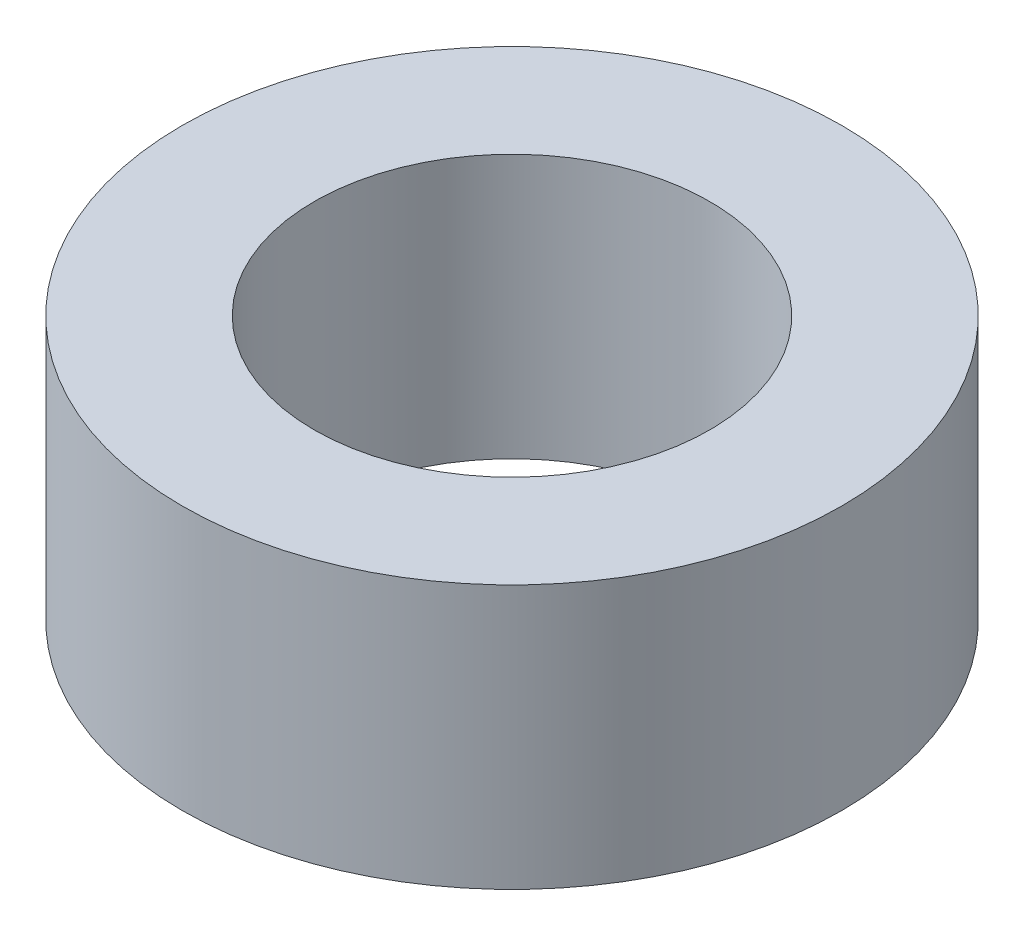
ISO-10303-21;
HEADER;
FILE_DESCRIPTION(('STEP AP214'),'2;1');
FILE_NAME('part.step','',(''),(''),'','','');
FILE_SCHEMA(('AUTOMOTIVE_DESIGN { 1 0 10303 214 1 1 1 1 }'));
ENDSEC;
DATA;
#1=APPLICATION_CONTEXT('core data for automotive mechanical design processes');
#2=APPLICATION_PROTOCOL_DEFINITION('international standard','automotive_design',2000,#1);
#3=PRODUCT_CONTEXT('',#1,'mechanical');
#4=PRODUCT('Part','Part','',(#3));
#5=PRODUCT_RELATED_PRODUCT_CATEGORY('part','',(#4));
#6=PRODUCT_DEFINITION_FORMATION('','',#4);
#7=PRODUCT_DEFINITION_CONTEXT('part definition',#1,'design');
#8=PRODUCT_DEFINITION('design','',#6,#7);
#9=PRODUCT_DEFINITION_SHAPE('','',#8);
#10=(LENGTH_UNIT() NAMED_UNIT(*) SI_UNIT(.MILLI.,.METRE.));
#11=(NAMED_UNIT(*) PLANE_ANGLE_UNIT() SI_UNIT($,.RADIAN.));
#12=(NAMED_UNIT(*) SI_UNIT($,.STERADIAN.) SOLID_ANGLE_UNIT());
#13=UNCERTAINTY_MEASURE_WITH_UNIT(LENGTH_MEASURE(1.E-05),#10,'distance_accuracy_value','');
#14=(GEOMETRIC_REPRESENTATION_CONTEXT(3) GLOBAL_UNCERTAINTY_ASSIGNED_CONTEXT((#13)) GLOBAL_UNIT_ASSIGNED_CONTEXT((#10,
#11,#12)) REPRESENTATION_CONTEXT('',''));
#15=CARTESIAN_POINT('',(0.,0.,0.));
#16=DIRECTION('',(0.,0.,1.));
#17=DIRECTION('',(1.,0.,0.));
#18=AXIS2_PLACEMENT_3D('',#15,#16,#17);
#19=CARTESIAN_POINT('',(0.,6.35,0.));
#20=DIRECTION('',(0.,-1.,0.));
#21=DIRECTION('',(0.,0.,-1.));
#22=AXIS2_PLACEMENT_3D('',#19,#20,#21);
#23=CYLINDRICAL_SURFACE('',#22,7.9375);
#24=CARTESIAN_POINT('',(0.,6.35,0.));
#25=DIRECTION('',(0.,1.,0.));
#26=DIRECTION('',(0.,0.,1.));
#27=AXIS2_PLACEMENT_3D('',#24,#25,#26);
#28=CIRCLE('',#27,7.9375);
#29=CARTESIAN_POINT('',(0.,6.35,7.9375));
#30=VERTEX_POINT('',#29);
#31=EDGE_CURVE('E10',#30,#30,#28,.T.);
#32=ORIENTED_EDGE('',*,*,#31,.F.);
#33=EDGE_LOOP('',(#32));
#34=FACE_BOUND('',#33,.T.);
#35=CARTESIAN_POINT('',(0.,0.,0.));
#36=DIRECTION('',(0.,1.,0.));
#37=DIRECTION('',(0.,0.,1.));
#38=AXIS2_PLACEMENT_3D('',#35,#36,#37);
#39=CIRCLE('',#38,7.9375);
#40=CARTESIAN_POINT('',(0.,0.,7.9375));
#41=VERTEX_POINT('',#40);
#42=EDGE_CURVE('E40',#41,#41,#39,.T.);
#43=ORIENTED_EDGE('',*,*,#42,.T.);
#44=EDGE_LOOP('',(#43));
#45=FACE_BOUND('',#44,.T.);
#46=ADVANCED_FACE('F37',(#34,#45),#23,.T.);
#47=CARTESIAN_POINT('',(0.,6.35,0.));
#48=DIRECTION('',(0.,1.,0.));
#49=DIRECTION('',(0.,0.,1.));
#50=AXIS2_PLACEMENT_3D('',#47,#48,#49);
#51=PLANE('',#50);
#52=CARTESIAN_POINT('',(0.,6.35,0.));
#53=DIRECTION('',(0.,1.,0.));
#54=DIRECTION('',(0.,0.,1.));
#55=AXIS2_PLACEMENT_3D('',#52,#53,#54);
#56=CIRCLE('',#55,4.7625);
#57=CARTESIAN_POINT('',(0.,6.35,4.7625));
#58=VERTEX_POINT('',#57);
#59=EDGE_CURVE('E51',#58,#58,#56,.T.);
#60=ORIENTED_EDGE('',*,*,#59,.F.);
#61=EDGE_LOOP('',(#60));
#62=FACE_BOUND('',#61,.T.);
#63=ORIENTED_EDGE('',*,*,#31,.T.);
#64=EDGE_LOOP('',(#63));
#65=FACE_BOUND('',#64,.T.);
#66=ADVANCED_FACE('F68',(#62,#65),#51,.T.);
#67=CARTESIAN_POINT('',(0.,0.,0.));
#68=DIRECTION('',(0.,1.,0.));
#69=DIRECTION('',(0.,0.,1.));
#70=AXIS2_PLACEMENT_3D('',#67,#68,#69);
#71=PLANE('',#70);
#72=CARTESIAN_POINT('',(0.,0.,0.));
#73=DIRECTION('',(0.,1.,0.));
#74=DIRECTION('',(0.,0.,1.));
#75=AXIS2_PLACEMENT_3D('',#72,#73,#74);
#76=CIRCLE('',#75,4.7625);
#77=CARTESIAN_POINT('',(0.,0.,4.7625));
#78=VERTEX_POINT('',#77);
#79=EDGE_CURVE('E49',#78,#78,#76,.T.);
#80=ORIENTED_EDGE('',*,*,#79,.T.);
#81=EDGE_LOOP('',(#80));
#82=FACE_BOUND('',#81,.T.);
#83=ORIENTED_EDGE('',*,*,#42,.F.);
#84=EDGE_LOOP('',(#83));
#85=FACE_BOUND('',#84,.T.);
#86=ADVANCED_FACE('F59',(#82,#85),#71,.F.);
#87=CARTESIAN_POINT('',(0.,0.,0.));
#88=DIRECTION('',(0.,1.,0.));
#89=DIRECTION('',(0.,0.,1.));
#90=AXIS2_PLACEMENT_3D('',#87,#88,#89);
#91=CYLINDRICAL_SURFACE('',#90,4.7625);
#92=ORIENTED_EDGE('',*,*,#79,.F.);
#93=EDGE_LOOP('',(#92));
#94=FACE_BOUND('',#93,.T.);
#95=ORIENTED_EDGE('',*,*,#59,.T.);
#96=EDGE_LOOP('',(#95));
#97=FACE_BOUND('',#96,.T.);
#98=ADVANCED_FACE('F62',(#94,#97),#91,.F.);
#99=CLOSED_SHELL('',(#46,#66,#86,#98));
#100=MANIFOLD_SOLID_BREP('B2',#99);
#101=ADVANCED_BREP_SHAPE_REPRESENTATION('',(#18,#100),#14);
#102=SHAPE_DEFINITION_REPRESENTATION(#9,#101);
ENDSEC;
END-ISO-10303-21;
